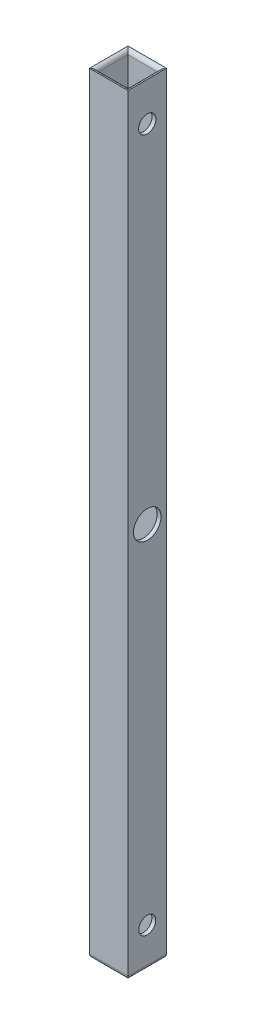
ISO-10303-21;
HEADER;
FILE_DESCRIPTION(('STEP AP214'),'2;1');
FILE_NAME('part.step','',(''),(''),'','','');
FILE_SCHEMA(('AUTOMOTIVE_DESIGN { 1 0 10303 214 1 1 1 1 }'));
ENDSEC;
DATA;
#1=APPLICATION_CONTEXT('core data for automotive mechanical design processes');
#2=APPLICATION_PROTOCOL_DEFINITION('international standard','automotive_design',2000,#1);
#3=PRODUCT_CONTEXT('',#1,'mechanical');
#4=PRODUCT('Part','Part','',(#3));
#5=PRODUCT_RELATED_PRODUCT_CATEGORY('part','',(#4));
#6=PRODUCT_DEFINITION_FORMATION('','',#4);
#7=PRODUCT_DEFINITION_CONTEXT('part definition',#1,'design');
#8=PRODUCT_DEFINITION('design','',#6,#7);
#9=PRODUCT_DEFINITION_SHAPE('','',#8);
#10=(LENGTH_UNIT() NAMED_UNIT(*) SI_UNIT(.MILLI.,.METRE.));
#11=(NAMED_UNIT(*) PLANE_ANGLE_UNIT() SI_UNIT($,.RADIAN.));
#12=(NAMED_UNIT(*) SI_UNIT($,.STERADIAN.) SOLID_ANGLE_UNIT());
#13=UNCERTAINTY_MEASURE_WITH_UNIT(LENGTH_MEASURE(1.E-05),#10,'distance_accuracy_value','');
#14=(GEOMETRIC_REPRESENTATION_CONTEXT(3) GLOBAL_UNCERTAINTY_ASSIGNED_CONTEXT((#13)) GLOBAL_UNIT_ASSIGNED_CONTEXT((#10,
#11,#12)) REPRESENTATION_CONTEXT('',''));
#15=CARTESIAN_POINT('',(0.,0.,0.));
#16=DIRECTION('',(0.,0.,1.));
#17=DIRECTION('',(1.,0.,0.));
#18=AXIS2_PLACEMENT_3D('',#15,#16,#17);
#19=CARTESIAN_POINT('',(5.,200.,-5.));
#20=DIRECTION('',(-1.,0.,0.));
#21=DIRECTION('',(0.,0.,1.));
#22=AXIS2_PLACEMENT_3D('',#19,#20,#21);
#23=PLANE('',#22);
#24=CARTESIAN_POINT('',(5.,190.,0.));
#25=DIRECTION('',(1.,0.,0.));
#26=DIRECTION('',(0.,0.,-1.));
#27=AXIS2_PLACEMENT_3D('',#24,#25,#26);
#28=CIRCLE('',#27,2.25);
#29=CARTESIAN_POINT('',(5.,190.,-2.25));
#30=VERTEX_POINT('',#29);
#31=EDGE_CURVE('E514',#30,#30,#28,.T.);
#32=ORIENTED_EDGE('',*,*,#31,.F.);
#33=EDGE_LOOP('',(#32));
#34=FACE_BOUND('',#33,.T.);
#35=CARTESIAN_POINT('',(5.,10.,0.));
#36=DIRECTION('',(1.,0.,0.));
#37=DIRECTION('',(0.,0.,-1.));
#38=AXIS2_PLACEMENT_3D('',#35,#36,#37);
#39=CIRCLE('',#38,2.2);
#40=CARTESIAN_POINT('',(5.,10.,-2.2));
#41=VERTEX_POINT('',#40);
#42=EDGE_CURVE('E489',#41,#41,#39,.T.);
#43=ORIENTED_EDGE('',*,*,#42,.F.);
#44=EDGE_LOOP('',(#43));
#45=FACE_BOUND('',#44,.T.);
#46=CARTESIAN_POINT('',(5.,100.,0.));
#47=DIRECTION('',(1.,0.,0.));
#48=DIRECTION('',(0.,0.,-1.));
#49=AXIS2_PLACEMENT_3D('',#46,#47,#48);
#50=CIRCLE('',#49,3.575);
#51=CARTESIAN_POINT('',(5.,100.,-3.575));
#52=VERTEX_POINT('',#51);
#53=EDGE_CURVE('E486',#52,#52,#50,.T.);
#54=ORIENTED_EDGE('',*,*,#53,.F.);
#55=EDGE_LOOP('',(#54));
#56=FACE_BOUND('',#55,.T.);
#57=DIRECTION('',(0.,-1.,0.));
#58=VECTOR('',#57,1.);
#59=CARTESIAN_POINT('',(5.,200.,5.));
#60=LINE('',#59,#58);
#61=CARTESIAN_POINT('',(5.,200.,5.));
#62=VERTEX_POINT('',#61);
#63=CARTESIAN_POINT('',(5.,1.,5.));
#64=VERTEX_POINT('',#63);
#65=EDGE_CURVE('E173',#62,#64,#60,.T.);
#66=ORIENTED_EDGE('',*,*,#65,.T.);
#67=DIRECTION('',(0.,0.,-1.));
#68=VECTOR('',#67,1.);
#69=CARTESIAN_POINT('',(5.,1.,-5.));
#70=LINE('',#69,#68);
#71=CARTESIAN_POINT('',(5.,1.,-5.));
#72=VERTEX_POINT('',#71);
#73=EDGE_CURVE('E189',#64,#72,#70,.T.);
#74=ORIENTED_EDGE('',*,*,#73,.T.);
#75=DIRECTION('',(0.,-1.,0.));
#76=VECTOR('',#75,1.);
#77=CARTESIAN_POINT('',(5.,200.,-5.));
#78=LINE('',#77,#76);
#79=CARTESIAN_POINT('',(5.,200.,-5.));
#80=VERTEX_POINT('',#79);
#81=EDGE_CURVE('E186',#80,#72,#78,.T.);
#82=ORIENTED_EDGE('',*,*,#81,.F.);
#83=DIRECTION('',(0.,0.,-1.));
#84=VECTOR('',#83,1.);
#85=CARTESIAN_POINT('',(5.,200.,-5.));
#86=LINE('',#85,#84);
#87=EDGE_CURVE('E175',#62,#80,#86,.T.);
#88=ORIENTED_EDGE('',*,*,#87,.F.);
#89=EDGE_LOOP('',(#66,#74,#82,#88));
#90=FACE_BOUND('',#89,.T.);
#91=ADVANCED_FACE('F37',(#34,#45,#56,#90),#23,.F.);
#92=CARTESIAN_POINT('',(-5.,200.,-5.));
#93=DIRECTION('',(0.,0.,1.));
#94=DIRECTION('',(1.,0.,0.));
#95=AXIS2_PLACEMENT_3D('',#92,#93,#94);
#96=PLANE('',#95);
#97=ORIENTED_EDGE('',*,*,#81,.T.);
#98=DIRECTION('',(-1.,0.,0.));
#99=VECTOR('',#98,1.);
#100=CARTESIAN_POINT('',(-5.,1.,-5.));
#101=LINE('',#100,#99);
#102=CARTESIAN_POINT('',(-5.,1.,-5.));
#103=VERTEX_POINT('',#102);
#104=EDGE_CURVE('E136',#72,#103,#101,.T.);
#105=ORIENTED_EDGE('',*,*,#104,.T.);
#106=DIRECTION('',(0.,-1.,0.));
#107=VECTOR('',#106,1.);
#108=CARTESIAN_POINT('',(-5.,200.,-5.));
#109=LINE('',#108,#107);
#110=CARTESIAN_POINT('',(-5.,200.,-5.));
#111=VERTEX_POINT('',#110);
#112=EDGE_CURVE('E184',#111,#103,#109,.T.);
#113=ORIENTED_EDGE('',*,*,#112,.F.);
#114=DIRECTION('',(-1.,0.,0.));
#115=VECTOR('',#114,1.);
#116=CARTESIAN_POINT('',(-5.,200.,-5.));
#117=LINE('',#116,#115);
#118=EDGE_CURVE('E171',#80,#111,#117,.T.);
#119=ORIENTED_EDGE('',*,*,#118,.F.);
#120=EDGE_LOOP('',(#97,#105,#113,#119));
#121=FACE_BOUND('',#120,.T.);
#122=ADVANCED_FACE('F224',(#121),#96,.F.);
#123=CARTESIAN_POINT('',(-5.,200.,-5.));
#124=DIRECTION('',(1.,0.,0.));
#125=DIRECTION('',(0.,0.,-1.));
#126=AXIS2_PLACEMENT_3D('',#123,#124,#125);
#127=PLANE('',#126);
#128=CARTESIAN_POINT('',(-5.,190.,0.));
#129=DIRECTION('',(1.,0.,0.));
#130=DIRECTION('',(0.,0.,-1.));
#131=AXIS2_PLACEMENT_3D('',#128,#129,#130);
#132=CIRCLE('',#131,2.25);
#133=CARTESIAN_POINT('',(-5.,190.,-2.25));
#134=VERTEX_POINT('',#133);
#135=EDGE_CURVE('E149',#134,#134,#132,.T.);
#136=ORIENTED_EDGE('',*,*,#135,.T.);
#137=EDGE_LOOP('',(#136));
#138=FACE_BOUND('',#137,.T.);
#139=CARTESIAN_POINT('',(-5.,10.,0.));
#140=DIRECTION('',(1.,0.,0.));
#141=DIRECTION('',(0.,0.,-1.));
#142=AXIS2_PLACEMENT_3D('',#139,#140,#141);
#143=CIRCLE('',#142,2.2);
#144=CARTESIAN_POINT('',(-5.,10.,-2.2));
#145=VERTEX_POINT('',#144);
#146=EDGE_CURVE('E511',#145,#145,#143,.T.);
#147=ORIENTED_EDGE('',*,*,#146,.T.);
#148=EDGE_LOOP('',(#147));
#149=FACE_BOUND('',#148,.T.);
#150=CARTESIAN_POINT('',(-5.,100.,0.));
#151=DIRECTION('',(1.,0.,0.));
#152=DIRECTION('',(0.,0.,-1.));
#153=AXIS2_PLACEMENT_3D('',#150,#151,#152);
#154=CIRCLE('',#153,3.575);
#155=CARTESIAN_POINT('',(-5.,100.,-3.575));
#156=VERTEX_POINT('',#155);
#157=EDGE_CURVE('E194',#156,#156,#154,.T.);
#158=ORIENTED_EDGE('',*,*,#157,.T.);
#159=EDGE_LOOP('',(#158));
#160=FACE_BOUND('',#159,.T.);
#161=ORIENTED_EDGE('',*,*,#112,.T.);
#162=DIRECTION('',(0.,0.,1.));
#163=VECTOR('',#162,1.);
#164=CARTESIAN_POINT('',(-5.,1.,-5.));
#165=LINE('',#164,#163);
#166=CARTESIAN_POINT('',(-5.,1.,5.));
#167=VERTEX_POINT('',#166);
#168=EDGE_CURVE('E204',#103,#167,#165,.T.);
#169=ORIENTED_EDGE('',*,*,#168,.T.);
#170=DIRECTION('',(0.,-1.,0.));
#171=VECTOR('',#170,1.);
#172=CARTESIAN_POINT('',(-5.,200.,5.));
#173=LINE('',#172,#171);
#174=CARTESIAN_POINT('',(-5.,200.,5.));
#175=VERTEX_POINT('',#174);
#176=EDGE_CURVE('E181',#175,#167,#173,.T.);
#177=ORIENTED_EDGE('',*,*,#176,.F.);
#178=DIRECTION('',(0.,0.,1.));
#179=VECTOR('',#178,1.);
#180=CARTESIAN_POINT('',(-5.,200.,-5.));
#181=LINE('',#180,#179);
#182=EDGE_CURVE('E167',#111,#175,#181,.T.);
#183=ORIENTED_EDGE('',*,*,#182,.F.);
#184=EDGE_LOOP('',(#161,#169,#177,#183));
#185=FACE_BOUND('',#184,.T.);
#186=ADVANCED_FACE('F240',(#138,#149,#160,#185),#127,.F.);
#187=CARTESIAN_POINT('',(-5.,200.,5.));
#188=DIRECTION('',(0.,0.,-1.));
#189=DIRECTION('',(-1.,0.,0.));
#190=AXIS2_PLACEMENT_3D('',#187,#188,#189);
#191=PLANE('',#190);
#192=ORIENTED_EDGE('',*,*,#176,.T.);
#193=DIRECTION('',(1.,0.,0.));
#194=VECTOR('',#193,1.);
#195=CARTESIAN_POINT('',(-5.,1.,5.));
#196=LINE('',#195,#194);
#197=EDGE_CURVE('E206',#167,#64,#196,.T.);
#198=ORIENTED_EDGE('',*,*,#197,.T.);
#199=ORIENTED_EDGE('',*,*,#65,.F.);
#200=DIRECTION('',(1.,0.,0.));
#201=VECTOR('',#200,1.);
#202=CARTESIAN_POINT('',(-5.,200.,5.));
#203=LINE('',#202,#201);
#204=EDGE_CURVE('E161',#175,#62,#203,.T.);
#205=ORIENTED_EDGE('',*,*,#204,.F.);
#206=EDGE_LOOP('',(#192,#198,#199,#205));
#207=FACE_BOUND('',#206,.T.);
#208=ADVANCED_FACE('F241',(#207),#191,.F.);
#209=CARTESIAN_POINT('',(4.,0.,0.));
#210=DIRECTION('',(-1.,0.,0.));
#211=DIRECTION('',(0.,0.,1.));
#212=AXIS2_PLACEMENT_3D('',#209,#210,#211);
#213=PLANE('',#212);
#214=CARTESIAN_POINT('',(4.,190.,0.));
#215=DIRECTION('',(-1.,0.,0.));
#216=DIRECTION('',(0.,0.,1.));
#217=AXIS2_PLACEMENT_3D('',#214,#215,#216);
#218=CIRCLE('',#217,2.25);
#219=CARTESIAN_POINT('',(4.,190.,2.25));
#220=VERTEX_POINT('',#219);
#221=EDGE_CURVE('E133',#220,#220,#218,.T.);
#222=ORIENTED_EDGE('',*,*,#221,.F.);
#223=EDGE_LOOP('',(#222));
#224=FACE_BOUND('',#223,.T.);
#225=CARTESIAN_POINT('',(4.,10.,0.));
#226=DIRECTION('',(-1.,0.,0.));
#227=DIRECTION('',(0.,0.,1.));
#228=AXIS2_PLACEMENT_3D('',#225,#226,#227);
#229=CIRCLE('',#228,2.2);
#230=CARTESIAN_POINT('',(4.,10.,2.2));
#231=VERTEX_POINT('',#230);
#232=EDGE_CURVE('E198',#231,#231,#229,.T.);
#233=ORIENTED_EDGE('',*,*,#232,.F.);
#234=EDGE_LOOP('',(#233));
#235=FACE_BOUND('',#234,.T.);
#236=CARTESIAN_POINT('',(4.,100.,0.));
#237=DIRECTION('',(-1.,0.,0.));
#238=DIRECTION('',(0.,0.,1.));
#239=AXIS2_PLACEMENT_3D('',#236,#237,#238);
#240=CIRCLE('',#239,3.575);
#241=CARTESIAN_POINT('',(4.,100.,3.575));
#242=VERTEX_POINT('',#241);
#243=EDGE_CURVE('E193',#242,#242,#240,.T.);
#244=ORIENTED_EDGE('',*,*,#243,.F.);
#245=EDGE_LOOP('',(#244));
#246=FACE_BOUND('',#245,.T.);
#247=DIRECTION('',(0.,1.,0.));
#248=VECTOR('',#247,1.);
#249=CARTESIAN_POINT('',(4.,0.,4.));
#250=LINE('',#249,#248);
#251=CARTESIAN_POINT('',(4.,0.,4.));
#252=VERTEX_POINT('',#251);
#253=CARTESIAN_POINT('',(4.,199.,4.));
#254=VERTEX_POINT('',#253);
#255=EDGE_CURVE('E212',#252,#254,#250,.T.);
#256=ORIENTED_EDGE('',*,*,#255,.T.);
#257=DIRECTION('',(0.,0.,1.));
#258=VECTOR('',#257,1.);
#259=CARTESIAN_POINT('',(4.,199.,0.));
#260=LINE('',#259,#258);
#261=CARTESIAN_POINT('',(4.,199.,-4.));
#262=VERTEX_POINT('',#261);
#263=EDGE_CURVE('E122',#254,#262,#260,.F.);
#264=ORIENTED_EDGE('',*,*,#263,.T.);
#265=DIRECTION('',(0.,1.,0.));
#266=VECTOR('',#265,1.);
#267=CARTESIAN_POINT('',(4.,0.,-4.));
#268=LINE('',#267,#266);
#269=CARTESIAN_POINT('',(4.,0.,-4.));
#270=VERTEX_POINT('',#269);
#271=EDGE_CURVE('E105',#270,#262,#268,.T.);
#272=ORIENTED_EDGE('',*,*,#271,.F.);
#273=DIRECTION('',(0.,0.,1.));
#274=VECTOR('',#273,1.);
#275=CARTESIAN_POINT('',(4.,0.,0.));
#276=LINE('',#275,#274);
#277=EDGE_CURVE('E112',#270,#252,#276,.T.);
#278=ORIENTED_EDGE('',*,*,#277,.T.);
#279=EDGE_LOOP('',(#256,#264,#272,#278));
#280=FACE_BOUND('',#279,.T.);
#281=ADVANCED_FACE('F119',(#224,#235,#246,#280),#213,.T.);
#282=CARTESIAN_POINT('',(0.,0.,4.));
#283=DIRECTION('',(0.,0.,1.));
#284=DIRECTION('',(1.,0.,0.));
#285=AXIS2_PLACEMENT_3D('',#282,#283,#284);
#286=PLANE('',#285);
#287=DIRECTION('',(0.,1.,0.));
#288=VECTOR('',#287,1.);
#289=CARTESIAN_POINT('',(-4.,0.,4.));
#290=LINE('',#289,#288);
#291=CARTESIAN_POINT('',(-4.,0.,4.));
#292=VERTEX_POINT('',#291);
#293=CARTESIAN_POINT('',(-4.,199.,4.));
#294=VERTEX_POINT('',#293);
#295=EDGE_CURVE('E213',#292,#294,#290,.T.);
#296=ORIENTED_EDGE('',*,*,#295,.T.);
#297=DIRECTION('',(1.,0.,0.));
#298=VECTOR('',#297,1.);
#299=CARTESIAN_POINT('',(4.,199.,4.));
#300=LINE('',#299,#298);
#301=EDGE_CURVE('E46',#294,#254,#300,.T.);
#302=ORIENTED_EDGE('',*,*,#301,.T.);
#303=ORIENTED_EDGE('',*,*,#255,.F.);
#304=DIRECTION('',(1.,0.,0.));
#305=VECTOR('',#304,1.);
#306=CARTESIAN_POINT('',(0.,0.,4.));
#307=LINE('',#306,#305);
#308=EDGE_CURVE('E123',#292,#252,#307,.T.);
#309=ORIENTED_EDGE('',*,*,#308,.F.);
#310=EDGE_LOOP('',(#296,#302,#303,#309));
#311=FACE_BOUND('',#310,.T.);
#312=ADVANCED_FACE('F210',(#311),#286,.F.);
#313=CARTESIAN_POINT('',(-4.,0.,0.));
#314=DIRECTION('',(-1.,0.,0.));
#315=DIRECTION('',(0.,0.,1.));
#316=AXIS2_PLACEMENT_3D('',#313,#314,#315);
#317=PLANE('',#316);
#318=CARTESIAN_POINT('',(-4.,190.,0.));
#319=DIRECTION('',(-1.,0.,0.));
#320=DIRECTION('',(0.,0.,1.));
#321=AXIS2_PLACEMENT_3D('',#318,#319,#320);
#322=CIRCLE('',#321,2.25);
#323=CARTESIAN_POINT('',(-4.,190.,2.25));
#324=VERTEX_POINT('',#323);
#325=EDGE_CURVE('E199',#324,#324,#322,.T.);
#326=ORIENTED_EDGE('',*,*,#325,.T.);
#327=EDGE_LOOP('',(#326));
#328=FACE_BOUND('',#327,.T.);
#329=CARTESIAN_POINT('',(-4.,10.,0.));
#330=DIRECTION('',(-1.,0.,0.));
#331=DIRECTION('',(0.,0.,1.));
#332=AXIS2_PLACEMENT_3D('',#329,#330,#331);
#333=CIRCLE('',#332,2.2);
#334=CARTESIAN_POINT('',(-4.,10.,2.2));
#335=VERTEX_POINT('',#334);
#336=EDGE_CURVE('E195',#335,#335,#333,.T.);
#337=ORIENTED_EDGE('',*,*,#336,.T.);
#338=EDGE_LOOP('',(#337));
#339=FACE_BOUND('',#338,.T.);
#340=CARTESIAN_POINT('',(-4.,100.,0.));
#341=DIRECTION('',(-1.,0.,0.));
#342=DIRECTION('',(0.,0.,1.));
#343=AXIS2_PLACEMENT_3D('',#340,#341,#342);
#344=CIRCLE('',#343,3.575);
#345=CARTESIAN_POINT('',(-4.,100.,3.575));
#346=VERTEX_POINT('',#345);
#347=EDGE_CURVE('E190',#346,#346,#344,.T.);
#348=ORIENTED_EDGE('',*,*,#347,.T.);
#349=EDGE_LOOP('',(#348));
#350=FACE_BOUND('',#349,.T.);
#351=DIRECTION('',(0.,1.,0.));
#352=VECTOR('',#351,1.);
#353=CARTESIAN_POINT('',(-4.,0.,-4.));
#354=LINE('',#353,#352);
#355=CARTESIAN_POINT('',(-4.,0.,-4.));
#356=VERTEX_POINT('',#355);
#357=CARTESIAN_POINT('',(-4.,199.,-4.));
#358=VERTEX_POINT('',#357);
#359=EDGE_CURVE('E106',#356,#358,#354,.T.);
#360=ORIENTED_EDGE('',*,*,#359,.T.);
#361=DIRECTION('',(0.,0.,1.));
#362=VECTOR('',#361,1.);
#363=CARTESIAN_POINT('',(-4.,199.,4.));
#364=LINE('',#363,#362);
#365=EDGE_CURVE('E59',#358,#294,#364,.T.);
#366=ORIENTED_EDGE('',*,*,#365,.T.);
#367=ORIENTED_EDGE('',*,*,#295,.F.);
#368=DIRECTION('',(0.,0.,1.));
#369=VECTOR('',#368,1.);
#370=CARTESIAN_POINT('',(-4.,0.,0.));
#371=LINE('',#370,#369);
#372=EDGE_CURVE('E111',#356,#292,#371,.T.);
#373=ORIENTED_EDGE('',*,*,#372,.F.);
#374=EDGE_LOOP('',(#360,#366,#367,#373));
#375=FACE_BOUND('',#374,.T.);
#376=ADVANCED_FACE('F236',(#328,#339,#350,#375),#317,.F.);
#377=CARTESIAN_POINT('',(0.,0.,-4.));
#378=DIRECTION('',(0.,0.,1.));
#379=DIRECTION('',(1.,0.,0.));
#380=AXIS2_PLACEMENT_3D('',#377,#378,#379);
#381=PLANE('',#380);
#382=ORIENTED_EDGE('',*,*,#271,.T.);
#383=DIRECTION('',(1.,0.,0.));
#384=VECTOR('',#383,1.);
#385=CARTESIAN_POINT('',(0.,199.,-4.));
#386=LINE('',#385,#384);
#387=EDGE_CURVE('E11',#262,#358,#386,.F.);
#388=ORIENTED_EDGE('',*,*,#387,.T.);
#389=ORIENTED_EDGE('',*,*,#359,.F.);
#390=DIRECTION('',(1.,0.,0.));
#391=VECTOR('',#390,1.);
#392=CARTESIAN_POINT('',(0.,0.,-4.));
#393=LINE('',#392,#391);
#394=EDGE_CURVE('E102',#356,#270,#393,.T.);
#395=ORIENTED_EDGE('',*,*,#394,.T.);
#396=EDGE_LOOP('',(#382,#388,#389,#395));
#397=FACE_BOUND('',#396,.T.);
#398=ADVANCED_FACE('F104',(#397),#381,.T.);
#399=CARTESIAN_POINT('',(-5.,100.,0.));
#400=DIRECTION('',(1.,0.,0.));
#401=DIRECTION('',(0.,0.,-1.));
#402=AXIS2_PLACEMENT_3D('',#399,#400,#401);
#403=CYLINDRICAL_SURFACE('',#402,3.575);
#404=ORIENTED_EDGE('',*,*,#157,.F.);
#405=EDGE_LOOP('',(#404));
#406=FACE_BOUND('',#405,.T.);
#407=ORIENTED_EDGE('',*,*,#347,.F.);
#408=EDGE_LOOP('',(#407));
#409=FACE_BOUND('',#408,.T.);
#410=ADVANCED_FACE('F323',(#406,#409),#403,.F.);
#411=CARTESIAN_POINT('',(-5.,10.,0.));
#412=DIRECTION('',(1.,0.,0.));
#413=DIRECTION('',(0.,0.,-1.));
#414=AXIS2_PLACEMENT_3D('',#411,#412,#413);
#415=CYLINDRICAL_SURFACE('',#414,2.2);
#416=ORIENTED_EDGE('',*,*,#146,.F.);
#417=EDGE_LOOP('',(#416));
#418=FACE_BOUND('',#417,.T.);
#419=ORIENTED_EDGE('',*,*,#336,.F.);
#420=EDGE_LOOP('',(#419));
#421=FACE_BOUND('',#420,.T.);
#422=ADVANCED_FACE('F315',(#418,#421),#415,.F.);
#423=CARTESIAN_POINT('',(-5.,190.,0.));
#424=DIRECTION('',(1.,0.,0.));
#425=DIRECTION('',(0.,0.,-1.));
#426=AXIS2_PLACEMENT_3D('',#423,#424,#425);
#427=CYLINDRICAL_SURFACE('',#426,2.25);
#428=ORIENTED_EDGE('',*,*,#135,.F.);
#429=EDGE_LOOP('',(#428));
#430=FACE_BOUND('',#429,.T.);
#431=ORIENTED_EDGE('',*,*,#325,.F.);
#432=EDGE_LOOP('',(#431));
#433=FACE_BOUND('',#432,.T.);
#434=ADVANCED_FACE('F306',(#430,#433),#427,.F.);
#435=ORIENTED_EDGE('',*,*,#243,.T.);
#436=EDGE_LOOP('',(#435));
#437=FACE_BOUND('',#436,.T.);
#438=ORIENTED_EDGE('',*,*,#53,.T.);
#439=EDGE_LOOP('',(#438));
#440=FACE_BOUND('',#439,.T.);
#441=ADVANCED_FACE('F312',(#437,#440),#403,.F.);
#442=ORIENTED_EDGE('',*,*,#232,.T.);
#443=EDGE_LOOP('',(#442));
#444=FACE_BOUND('',#443,.T.);
#445=ORIENTED_EDGE('',*,*,#42,.T.);
#446=EDGE_LOOP('',(#445));
#447=FACE_BOUND('',#446,.T.);
#448=ADVANCED_FACE('F303',(#444,#447),#415,.F.);
#449=ORIENTED_EDGE('',*,*,#221,.T.);
#450=EDGE_LOOP('',(#449));
#451=FACE_BOUND('',#450,.T.);
#452=ORIENTED_EDGE('',*,*,#31,.T.);
#453=EDGE_LOOP('',(#452));
#454=FACE_BOUND('',#453,.T.);
#455=ADVANCED_FACE('F270',(#451,#454),#427,.F.);
#456=CARTESIAN_POINT('',(-4.,1.,-5.));
#457=DIRECTION('',(0.,0.,1.));
#458=DIRECTION('',(1.,0.,0.));
#459=AXIS2_PLACEMENT_3D('',#456,#457,#458);
#460=CYLINDRICAL_SURFACE('',#459,1.);
#461=CARTESIAN_POINT('',(-4.,1.,-4.));
#462=DIRECTION('',(-0.707106781186547,0.,0.707106781186547));
#463=DIRECTION('',(0.707106781186547,0.,0.707106781186547));
#464=AXIS2_PLACEMENT_3D('',#461,#462,#463);
#465=ELLIPSE('',#464,1.41421356237309,1.);
#466=EDGE_CURVE('E139',#356,#103,#465,.F.);
#467=ORIENTED_EDGE('',*,*,#466,.F.);
#468=ORIENTED_EDGE('',*,*,#372,.T.);
#469=CARTESIAN_POINT('',(-4.,1.,4.));
#470=DIRECTION('',(0.707106781186547,0.,0.707106781186547));
#471=DIRECTION('',(0.707106781186547,0.,-0.707106781186547));
#472=AXIS2_PLACEMENT_3D('',#469,#470,#471);
#473=ELLIPSE('',#472,1.41421356237309,1.);
#474=EDGE_CURVE('E146',#167,#292,#473,.T.);
#475=ORIENTED_EDGE('',*,*,#474,.F.);
#476=ORIENTED_EDGE('',*,*,#168,.F.);
#477=EDGE_LOOP('',(#467,#468,#475,#476));
#478=FACE_BOUND('',#477,.T.);
#479=ADVANCED_FACE('F238',(#478),#460,.T.);
#480=CARTESIAN_POINT('',(-5.,1.,4.));
#481=DIRECTION('',(1.,0.,0.));
#482=DIRECTION('',(0.,0.,-1.));
#483=AXIS2_PLACEMENT_3D('',#480,#481,#482);
#484=CYLINDRICAL_SURFACE('',#483,1.);
#485=ORIENTED_EDGE('',*,*,#474,.T.);
#486=ORIENTED_EDGE('',*,*,#308,.T.);
#487=CARTESIAN_POINT('',(4.,1.,4.));
#488=DIRECTION('',(0.707106781186547,0.,-0.707106781186548));
#489=DIRECTION('',(0.707106781186547,0.,0.707106781186547));
#490=AXIS2_PLACEMENT_3D('',#487,#488,#489);
#491=ELLIPSE('',#490,1.4142135623731,1.);
#492=EDGE_CURVE('E131',#64,#252,#491,.T.);
#493=ORIENTED_EDGE('',*,*,#492,.F.);
#494=ORIENTED_EDGE('',*,*,#197,.F.);
#495=EDGE_LOOP('',(#485,#486,#493,#494));
#496=FACE_BOUND('',#495,.T.);
#497=ADVANCED_FACE('F229',(#496),#484,.T.);
#498=CARTESIAN_POINT('',(-5.,1.,-4.));
#499=DIRECTION('',(-1.,0.,0.));
#500=DIRECTION('',(0.,0.,1.));
#501=AXIS2_PLACEMENT_3D('',#498,#499,#500);
#502=CYLINDRICAL_SURFACE('',#501,1.);
#503=ORIENTED_EDGE('',*,*,#466,.T.);
#504=ORIENTED_EDGE('',*,*,#104,.F.);
#505=CARTESIAN_POINT('',(4.,1.,-4.));
#506=DIRECTION('',(-0.707106781186547,0.,-0.707106781186547));
#507=DIRECTION('',(-0.707106781186547,0.,0.707106781186548));
#508=AXIS2_PLACEMENT_3D('',#505,#506,#507);
#509=ELLIPSE('',#508,1.41421356237309,1.);
#510=EDGE_CURVE('E128',#270,#72,#509,.F.);
#511=ORIENTED_EDGE('',*,*,#510,.F.);
#512=ORIENTED_EDGE('',*,*,#394,.F.);
#513=EDGE_LOOP('',(#503,#504,#511,#512));
#514=FACE_BOUND('',#513,.T.);
#515=ADVANCED_FACE('F135',(#514),#502,.T.);
#516=CARTESIAN_POINT('',(4.,1.,-5.));
#517=DIRECTION('',(0.,0.,-1.));
#518=DIRECTION('',(-1.,0.,0.));
#519=AXIS2_PLACEMENT_3D('',#516,#517,#518);
#520=CYLINDRICAL_SURFACE('',#519,1.);
#521=ORIENTED_EDGE('',*,*,#492,.T.);
#522=ORIENTED_EDGE('',*,*,#277,.F.);
#523=ORIENTED_EDGE('',*,*,#510,.T.);
#524=ORIENTED_EDGE('',*,*,#73,.F.);
#525=EDGE_LOOP('',(#521,#522,#523,#524));
#526=FACE_BOUND('',#525,.T.);
#527=ADVANCED_FACE('F126',(#526),#520,.T.);
#528=CARTESIAN_POINT('',(-5.,199.,0.));
#529=DIRECTION('',(0.,0.,-1.));
#530=DIRECTION('',(-1.,0.,0.));
#531=AXIS2_PLACEMENT_3D('',#528,#529,#530);
#532=CYLINDRICAL_SURFACE('',#531,1.);
#533=CARTESIAN_POINT('',(-5.,199.,5.));
#534=DIRECTION('',(-0.707106781186548,0.,-0.707106781186547));
#535=DIRECTION('',(0.707106781186547,0.,-0.707106781186547));
#536=AXIS2_PLACEMENT_3D('',#533,#534,#535);
#537=ELLIPSE('',#536,1.4142135623731,1.);
#538=EDGE_CURVE('E142',#294,#175,#537,.F.);
#539=ORIENTED_EDGE('',*,*,#538,.F.);
#540=ORIENTED_EDGE('',*,*,#365,.F.);
#541=CARTESIAN_POINT('',(-5.,199.,-5.));
#542=DIRECTION('',(0.707106781186547,0.,-0.707106781186547));
#543=DIRECTION('',(-0.707106781186547,0.,-0.707106781186547));
#544=AXIS2_PLACEMENT_3D('',#541,#542,#543);
#545=ELLIPSE('',#544,1.41421356237309,1.);
#546=EDGE_CURVE('E41',#111,#358,#545,.T.);
#547=ORIENTED_EDGE('',*,*,#546,.F.);
#548=ORIENTED_EDGE('',*,*,#182,.T.);
#549=EDGE_LOOP('',(#539,#540,#547,#548));
#550=FACE_BOUND('',#549,.T.);
#551=ADVANCED_FACE('F39',(#550),#532,.T.);
#552=CARTESIAN_POINT('',(0.,199.,-5.));
#553=DIRECTION('',(1.,0.,0.));
#554=DIRECTION('',(0.,0.,-1.));
#555=AXIS2_PLACEMENT_3D('',#552,#553,#554);
#556=CYLINDRICAL_SURFACE('',#555,1.);
#557=ORIENTED_EDGE('',*,*,#546,.T.);
#558=ORIENTED_EDGE('',*,*,#387,.F.);
#559=CARTESIAN_POINT('',(5.,199.,-5.));
#560=DIRECTION('',(0.707106781186547,0.,0.707106781186547));
#561=DIRECTION('',(-0.707106781186547,0.,0.707106781186547));
#562=AXIS2_PLACEMENT_3D('',#559,#560,#561);
#563=ELLIPSE('',#562,1.41421356237309,1.);
#564=EDGE_CURVE('E152',#80,#262,#563,.T.);
#565=ORIENTED_EDGE('',*,*,#564,.F.);
#566=ORIENTED_EDGE('',*,*,#118,.T.);
#567=EDGE_LOOP('',(#557,#558,#565,#566));
#568=FACE_BOUND('',#567,.T.);
#569=ADVANCED_FACE('F221',(#568),#556,.T.);
#570=CARTESIAN_POINT('',(0.,199.,5.));
#571=DIRECTION('',(-1.,0.,0.));
#572=DIRECTION('',(0.,0.,1.));
#573=AXIS2_PLACEMENT_3D('',#570,#571,#572);
#574=CYLINDRICAL_SURFACE('',#573,1.);
#575=ORIENTED_EDGE('',*,*,#538,.T.);
#576=ORIENTED_EDGE('',*,*,#204,.T.);
#577=CARTESIAN_POINT('',(5.,199.,5.));
#578=DIRECTION('',(-0.707106781186547,0.,0.707106781186547));
#579=DIRECTION('',(0.707106781186548,0.,0.707106781186547));
#580=AXIS2_PLACEMENT_3D('',#577,#578,#579);
#581=ELLIPSE('',#580,1.41421356237309,1.);
#582=EDGE_CURVE('E150',#254,#62,#581,.F.);
#583=ORIENTED_EDGE('',*,*,#582,.F.);
#584=ORIENTED_EDGE('',*,*,#301,.F.);
#585=EDGE_LOOP('',(#575,#576,#583,#584));
#586=FACE_BOUND('',#585,.T.);
#587=ADVANCED_FACE('F158',(#586),#574,.T.);
#588=CARTESIAN_POINT('',(5.,199.,0.));
#589=DIRECTION('',(0.,0.,1.));
#590=DIRECTION('',(1.,0.,0.));
#591=AXIS2_PLACEMENT_3D('',#588,#589,#590);
#592=CYLINDRICAL_SURFACE('',#591,1.);
#593=ORIENTED_EDGE('',*,*,#564,.T.);
#594=ORIENTED_EDGE('',*,*,#263,.F.);
#595=ORIENTED_EDGE('',*,*,#582,.T.);
#596=ORIENTED_EDGE('',*,*,#87,.T.);
#597=EDGE_LOOP('',(#593,#594,#595,#596));
#598=FACE_BOUND('',#597,.T.);
#599=ADVANCED_FACE('F216',(#598),#592,.T.);
#600=CLOSED_SHELL('',(#91,#122,#186,#208,#281,#312,#376,#398,#410,#422,#434,#441,#448,#455,#479,
#497,#515,#527,#551,#569,#587,#599));
#601=MANIFOLD_SOLID_BREP('B2',#600);
#602=ADVANCED_BREP_SHAPE_REPRESENTATION('',(#18,#601),#14);
#603=SHAPE_DEFINITION_REPRESENTATION(#9,#602);
ENDSEC;
END-ISO-10303-21;
